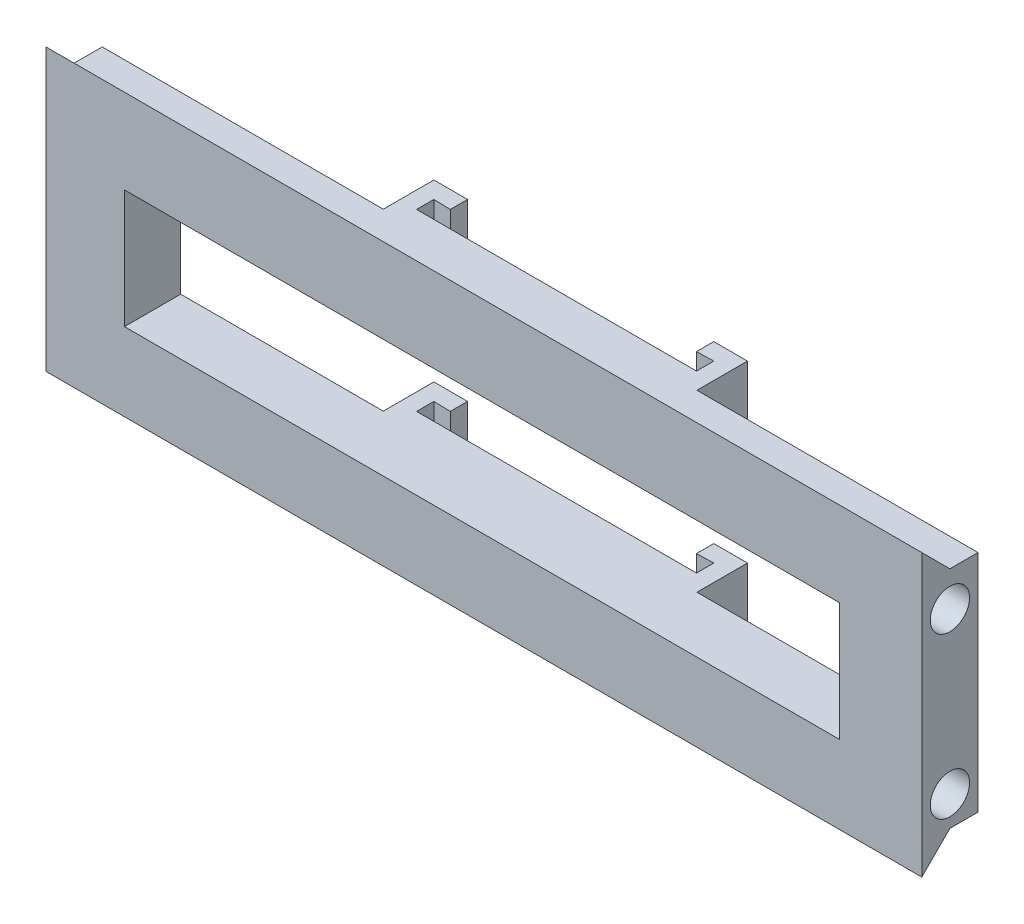
ISO-10303-21;
HEADER;
FILE_DESCRIPTION(('STEP AP214'),'2;1');
FILE_NAME('part.step','',(''),(''),'','','');
FILE_SCHEMA(('AUTOMOTIVE_DESIGN { 1 0 10303 214 1 1 1 1 }'));
ENDSEC;
DATA;
#1=APPLICATION_CONTEXT('core data for automotive mechanical design processes');
#2=APPLICATION_PROTOCOL_DEFINITION('international standard','automotive_design',2000,#1);
#3=PRODUCT_CONTEXT('',#1,'mechanical');
#4=PRODUCT('Part','Part','',(#3));
#5=PRODUCT_RELATED_PRODUCT_CATEGORY('part','',(#4));
#6=PRODUCT_DEFINITION_FORMATION('','',#4);
#7=PRODUCT_DEFINITION_CONTEXT('part definition',#1,'design');
#8=PRODUCT_DEFINITION('design','',#6,#7);
#9=PRODUCT_DEFINITION_SHAPE('','',#8);
#10=(LENGTH_UNIT() NAMED_UNIT(*) SI_UNIT(.MILLI.,.METRE.));
#11=(NAMED_UNIT(*) PLANE_ANGLE_UNIT() SI_UNIT($,.RADIAN.));
#12=(NAMED_UNIT(*) SI_UNIT($,.STERADIAN.) SOLID_ANGLE_UNIT());
#13=UNCERTAINTY_MEASURE_WITH_UNIT(LENGTH_MEASURE(1.E-05),#10,'distance_accuracy_value','');
#14=(GEOMETRIC_REPRESENTATION_CONTEXT(3) GLOBAL_UNCERTAINTY_ASSIGNED_CONTEXT((#13)) GLOBAL_UNIT_ASSIGNED_CONTEXT((#10,
#11,#12)) REPRESENTATION_CONTEXT('',''));
#15=CARTESIAN_POINT('',(0.,0.,0.));
#16=DIRECTION('',(0.,0.,1.));
#17=DIRECTION('',(1.,0.,0.));
#18=AXIS2_PLACEMENT_3D('',#15,#16,#17);
#19=CARTESIAN_POINT('',(0.,0.,0.));
#20=DIRECTION('',(0.,1.,0.));
#21=DIRECTION('',(0.,0.,1.));
#22=AXIS2_PLACEMENT_3D('',#19,#20,#21);
#23=PLANE('',#22);
#24=DIRECTION('',(1.,0.,0.));
#25=VECTOR('',#24,1.);
#26=CARTESIAN_POINT('',(-120.839198305537,0.,24.6440244675633));
#27=LINE('',#26,#25);
#28=CARTESIAN_POINT('',(-113.768130493671,0.,24.6440244675633));
#29=VERTEX_POINT('',#28);
#30=CARTESIAN_POINT('',(42.0318695063289,0.,24.6440244675633));
#31=VERTEX_POINT('',#30);
#32=EDGE_CURVE('E55',#29,#31,#27,.T.);
#33=ORIENTED_EDGE('',*,*,#32,.F.);
#34=DIRECTION('',(0.,0.,1.));
#35=VECTOR('',#34,1.);
#36=CARTESIAN_POINT('',(-113.768130493671,0.,0.));
#37=LINE('',#36,#35);
#38=CARTESIAN_POINT('',(-113.768130493671,0.,19.6440244675633));
#39=VERTEX_POINT('',#38);
#40=EDGE_CURVE('E268',#39,#29,#37,.T.);
#41=ORIENTED_EDGE('',*,*,#40,.F.);
#42=DIRECTION('',(-1.,0.,0.));
#43=VECTOR('',#42,1.);
#44=CARTESIAN_POINT('',(0.,0.,19.6440244675633));
#45=LINE('',#44,#43);
#46=CARTESIAN_POINT('',(-63.7681304936711,0.,19.6440244675633));
#47=VERTEX_POINT('',#46);
#48=EDGE_CURVE('E430',#47,#39,#45,.T.);
#49=ORIENTED_EDGE('',*,*,#48,.F.);
#50=DIRECTION('',(0.,0.,1.));
#51=VECTOR('',#50,1.);
#52=CARTESIAN_POINT('',(-63.7681304936711,0.,0.));
#53=LINE('',#52,#51);
#54=CARTESIAN_POINT('',(-63.7681304936711,0.,10.6440244675633));
#55=VERTEX_POINT('',#54);
#56=EDGE_CURVE('E428',#55,#47,#53,.T.);
#57=ORIENTED_EDGE('',*,*,#56,.F.);
#58=DIRECTION('',(1.,0.,0.));
#59=VECTOR('',#58,1.);
#60=CARTESIAN_POINT('',(0.,0.,10.6440244675633));
#61=LINE('',#60,#59);
#62=CARTESIAN_POINT('',(-57.7681304936711,0.,10.6440244675633));
#63=VERTEX_POINT('',#62);
#64=EDGE_CURVE('E425',#55,#63,#61,.T.);
#65=ORIENTED_EDGE('',*,*,#64,.T.);
#66=DIRECTION('',(0.,0.,1.));
#67=VECTOR('',#66,1.);
#68=CARTESIAN_POINT('',(-57.7681304936711,0.,0.));
#69=LINE('',#68,#67);
#70=CARTESIAN_POINT('',(-57.7681304936711,0.,13.7266501884196));
#71=VERTEX_POINT('',#70);
#72=EDGE_CURVE('E422',#63,#71,#69,.T.);
#73=ORIENTED_EDGE('',*,*,#72,.T.);
#74=DIRECTION('',(-0.999620937322477,0.,-0.0275314668430937));
#75=VECTOR('',#74,1.);
#76=CARTESIAN_POINT('',(-0.421558744951801,0.,15.306084131544));
#77=LINE('',#76,#75);
#78=CARTESIAN_POINT('',(-60.7681304936711,0.,13.6440244675633));
#79=VERTEX_POINT('',#78);
#80=EDGE_CURVE('E419',#71,#79,#77,.T.);
#81=ORIENTED_EDGE('',*,*,#80,.T.);
#82=DIRECTION('',(0.,0.,1.));
#83=VECTOR('',#82,1.);
#84=CARTESIAN_POINT('',(-60.7681304936711,0.,0.));
#85=LINE('',#84,#83);
#86=CARTESIAN_POINT('',(-60.7681304936711,0.,16.7266501884196));
#87=VERTEX_POINT('',#86);
#88=EDGE_CURVE('E416',#79,#87,#85,.T.);
#89=ORIENTED_EDGE('',*,*,#88,.T.);
#90=DIRECTION('',(1.,0.,0.));
#91=VECTOR('',#90,1.);
#92=CARTESIAN_POINT('',(0.,0.,16.7266501884196));
#93=LINE('',#92,#91);
#94=CARTESIAN_POINT('',(-10.9681304936711,0.,16.7266501884196));
#95=VERTEX_POINT('',#94);
#96=EDGE_CURVE('E413',#87,#95,#93,.T.);
#97=ORIENTED_EDGE('',*,*,#96,.T.);
#98=DIRECTION('',(0.,0.,-1.));
#99=VECTOR('',#98,1.);
#100=CARTESIAN_POINT('',(-10.9681304936711,0.,0.));
#101=LINE('',#100,#99);
#102=CARTESIAN_POINT('',(-10.9681304936711,0.,13.6440244675633));
#103=VERTEX_POINT('',#102);
#104=EDGE_CURVE('E410',#95,#103,#101,.T.);
#105=ORIENTED_EDGE('',*,*,#104,.T.);
#106=DIRECTION('',(0.999620937322477,0.,-0.0275314668430943));
#107=VECTOR('',#106,1.);
#108=CARTESIAN_POINT('',(0.367183974297822,0.,13.3318282912139));
#109=LINE('',#108,#107);
#110=CARTESIAN_POINT('',(-13.9681304936711,0.,13.7266501884196));
#111=VERTEX_POINT('',#110);
#112=EDGE_CURVE('E407',#111,#103,#109,.T.);
#113=ORIENTED_EDGE('',*,*,#112,.F.);
#114=DIRECTION('',(0.,0.,1.));
#115=VECTOR('',#114,1.);
#116=CARTESIAN_POINT('',(-13.9681304936711,0.,0.));
#117=LINE('',#116,#115);
#118=CARTESIAN_POINT('',(-13.9681304936711,0.,10.6440244675633));
#119=VERTEX_POINT('',#118);
#120=EDGE_CURVE('E403',#119,#111,#117,.T.);
#121=ORIENTED_EDGE('',*,*,#120,.F.);
#122=DIRECTION('',(1.,0.,0.));
#123=VECTOR('',#122,1.);
#124=CARTESIAN_POINT('',(0.,0.,10.6440244675633));
#125=LINE('',#124,#123);
#126=CARTESIAN_POINT('',(-7.96813049367114,0.,10.6440244675633));
#127=VERTEX_POINT('',#126);
#128=EDGE_CURVE('E400',#119,#127,#125,.T.);
#129=ORIENTED_EDGE('',*,*,#128,.T.);
#130=DIRECTION('',(0.,0.,1.));
#131=VECTOR('',#130,1.);
#132=CARTESIAN_POINT('',(-7.96813049367113,0.,0.));
#133=LINE('',#132,#131);
#134=CARTESIAN_POINT('',(-7.96813049367114,0.,19.6440244675633));
#135=VERTEX_POINT('',#134);
#136=EDGE_CURVE('E320',#127,#135,#133,.T.);
#137=ORIENTED_EDGE('',*,*,#136,.T.);
#138=DIRECTION('',(1.,0.,0.));
#139=VECTOR('',#138,1.);
#140=CARTESIAN_POINT('',(0.,0.,19.6440244675633));
#141=LINE('',#140,#139);
#142=CARTESIAN_POINT('',(42.0318695063289,0.,19.6440244675633));
#143=VERTEX_POINT('',#142);
#144=EDGE_CURVE('E265',#135,#143,#141,.T.);
#145=ORIENTED_EDGE('',*,*,#144,.T.);
#146=DIRECTION('',(0.,0.,1.));
#147=VECTOR('',#146,1.);
#148=CARTESIAN_POINT('',(42.0318695063289,0.,0.));
#149=LINE('',#148,#147);
#150=EDGE_CURVE('E262',#143,#31,#149,.T.);
#151=ORIENTED_EDGE('',*,*,#150,.T.);
#152=EDGE_LOOP('',(#33,#41,#49,#57,#65,#73,#81,#89,#97,#105,#113,#121,#129,#137,#145,#151));
#153=FACE_BOUND('',#152,.T.);
#154=ADVANCED_FACE('F38',(#153),#23,.F.);
#155=CARTESIAN_POINT('',(0.,40.,0.));
#156=DIRECTION('',(0.,1.,0.));
#157=DIRECTION('',(0.,0.,1.));
#158=AXIS2_PLACEMENT_3D('',#155,#156,#157);
#159=PLANE('',#158);
#160=DIRECTION('',(0.,0.,1.));
#161=VECTOR('',#160,1.);
#162=CARTESIAN_POINT('',(-113.768130493671,40.,0.));
#163=LINE('',#162,#161);
#164=CARTESIAN_POINT('',(-113.768130493671,40.,19.6440244675633));
#165=VERTEX_POINT('',#164);
#166=CARTESIAN_POINT('',(-113.768130493671,40.,24.6440244675633));
#167=VERTEX_POINT('',#166);
#168=EDGE_CURVE('E382',#165,#167,#163,.T.);
#169=ORIENTED_EDGE('',*,*,#168,.T.);
#170=DIRECTION('',(1.,0.,0.));
#171=VECTOR('',#170,1.);
#172=CARTESIAN_POINT('',(-120.839198305537,40.,24.6440244675633));
#173=LINE('',#172,#171);
#174=CARTESIAN_POINT('',(42.0318695063289,40.,24.6440244675633));
#175=VERTEX_POINT('',#174);
#176=EDGE_CURVE('E293',#167,#175,#173,.T.);
#177=ORIENTED_EDGE('',*,*,#176,.T.);
#178=DIRECTION('',(0.,0.,1.));
#179=VECTOR('',#178,1.);
#180=CARTESIAN_POINT('',(42.0318695063289,40.,0.));
#181=LINE('',#180,#179);
#182=CARTESIAN_POINT('',(42.0318695063289,40.,19.6440244675633));
#183=VERTEX_POINT('',#182);
#184=EDGE_CURVE('E386',#183,#175,#181,.T.);
#185=ORIENTED_EDGE('',*,*,#184,.F.);
#186=DIRECTION('',(1.,0.,0.));
#187=VECTOR('',#186,1.);
#188=CARTESIAN_POINT('',(0.,40.,19.6440244675633));
#189=LINE('',#188,#187);
#190=CARTESIAN_POINT('',(-7.96813049367114,40.,19.6440244675633));
#191=VERTEX_POINT('',#190);
#192=EDGE_CURVE('E394',#191,#183,#189,.T.);
#193=ORIENTED_EDGE('',*,*,#192,.F.);
#194=DIRECTION('',(0.,0.,1.));
#195=VECTOR('',#194,1.);
#196=CARTESIAN_POINT('',(-7.96813049367113,40.,0.));
#197=LINE('',#196,#195);
#198=CARTESIAN_POINT('',(-7.96813049367114,40.,10.6440244675633));
#199=VERTEX_POINT('',#198);
#200=EDGE_CURVE('E397',#199,#191,#197,.T.);
#201=ORIENTED_EDGE('',*,*,#200,.F.);
#202=DIRECTION('',(1.,0.,0.));
#203=VECTOR('',#202,1.);
#204=CARTESIAN_POINT('',(0.,40.,10.6440244675633));
#205=LINE('',#204,#203);
#206=CARTESIAN_POINT('',(-13.9681304936711,40.,10.6440244675633));
#207=VERTEX_POINT('',#206);
#208=EDGE_CURVE('E322',#207,#199,#205,.T.);
#209=ORIENTED_EDGE('',*,*,#208,.F.);
#210=DIRECTION('',(0.,0.,1.));
#211=VECTOR('',#210,1.);
#212=CARTESIAN_POINT('',(-13.9681304936711,40.,0.));
#213=LINE('',#212,#211);
#214=CARTESIAN_POINT('',(-13.9681304936711,40.,13.7266501884196));
#215=VERTEX_POINT('',#214);
#216=EDGE_CURVE('E887',#207,#215,#213,.T.);
#217=ORIENTED_EDGE('',*,*,#216,.T.);
#218=DIRECTION('',(0.999620937322477,0.,-0.0275314668430943));
#219=VECTOR('',#218,1.);
#220=CARTESIAN_POINT('',(0.367183974297822,40.,13.3318282912139));
#221=LINE('',#220,#219);
#222=CARTESIAN_POINT('',(-10.9681304936711,40.,13.6440244675633));
#223=VERTEX_POINT('',#222);
#224=EDGE_CURVE('E890',#215,#223,#221,.T.);
#225=ORIENTED_EDGE('',*,*,#224,.T.);
#226=DIRECTION('',(0.,0.,-1.));
#227=VECTOR('',#226,1.);
#228=CARTESIAN_POINT('',(-10.9681304936711,40.,0.));
#229=LINE('',#228,#227);
#230=CARTESIAN_POINT('',(-10.9681304936711,40.,16.7266501884196));
#231=VERTEX_POINT('',#230);
#232=EDGE_CURVE('E897',#231,#223,#229,.T.);
#233=ORIENTED_EDGE('',*,*,#232,.F.);
#234=DIRECTION('',(1.,0.,0.));
#235=VECTOR('',#234,1.);
#236=CARTESIAN_POINT('',(0.,40.,16.7266501884196));
#237=LINE('',#236,#235);
#238=CARTESIAN_POINT('',(-60.7681304936711,40.,16.7266501884196));
#239=VERTEX_POINT('',#238);
#240=EDGE_CURVE('E900',#239,#231,#237,.T.);
#241=ORIENTED_EDGE('',*,*,#240,.F.);
#242=DIRECTION('',(0.,0.,1.));
#243=VECTOR('',#242,1.);
#244=CARTESIAN_POINT('',(-60.7681304936711,40.,0.));
#245=LINE('',#244,#243);
#246=CARTESIAN_POINT('',(-60.7681304936711,40.,13.6440244675633));
#247=VERTEX_POINT('',#246);
#248=EDGE_CURVE('E903',#247,#239,#245,.T.);
#249=ORIENTED_EDGE('',*,*,#248,.F.);
#250=DIRECTION('',(-0.999620937322477,0.,-0.0275314668430937));
#251=VECTOR('',#250,1.);
#252=CARTESIAN_POINT('',(-0.421558744951801,40.,15.306084131544));
#253=LINE('',#252,#251);
#254=CARTESIAN_POINT('',(-57.7681304936711,40.,13.7266501884196));
#255=VERTEX_POINT('',#254);
#256=EDGE_CURVE('E906',#255,#247,#253,.T.);
#257=ORIENTED_EDGE('',*,*,#256,.F.);
#258=DIRECTION('',(0.,0.,1.));
#259=VECTOR('',#258,1.);
#260=CARTESIAN_POINT('',(-57.7681304936711,40.,0.));
#261=LINE('',#260,#259);
#262=CARTESIAN_POINT('',(-57.7681304936711,40.,10.6440244675633));
#263=VERTEX_POINT('',#262);
#264=EDGE_CURVE('E909',#263,#255,#261,.T.);
#265=ORIENTED_EDGE('',*,*,#264,.F.);
#266=DIRECTION('',(1.,0.,0.));
#267=VECTOR('',#266,1.);
#268=CARTESIAN_POINT('',(0.,40.,10.6440244675633));
#269=LINE('',#268,#267);
#270=CARTESIAN_POINT('',(-63.7681304936711,40.,10.6440244675633));
#271=VERTEX_POINT('',#270);
#272=EDGE_CURVE('E912',#271,#263,#269,.T.);
#273=ORIENTED_EDGE('',*,*,#272,.F.);
#274=DIRECTION('',(0.,0.,1.));
#275=VECTOR('',#274,1.);
#276=CARTESIAN_POINT('',(-63.7681304936711,40.,0.));
#277=LINE('',#276,#275);
#278=CARTESIAN_POINT('',(-63.7681304936711,40.,19.6440244675633));
#279=VERTEX_POINT('',#278);
#280=EDGE_CURVE('E914',#271,#279,#277,.T.);
#281=ORIENTED_EDGE('',*,*,#280,.T.);
#282=DIRECTION('',(-1.,0.,0.));
#283=VECTOR('',#282,1.);
#284=CARTESIAN_POINT('',(0.,40.,19.6440244675633));
#285=LINE('',#284,#283);
#286=EDGE_CURVE('E387',#279,#165,#285,.T.);
#287=ORIENTED_EDGE('',*,*,#286,.T.);
#288=EDGE_LOOP('',(#169,#177,#185,#193,#201,#209,#217,#225,#233,#241,#249,#257,#265,#273,#281,#287));
#289=FACE_BOUND('',#288,.T.);
#290=ADVANCED_FACE('F503',(#289),#159,.T.);
#291=CARTESIAN_POINT('',(0.,40.,10.6440244675633));
#292=DIRECTION('',(0.,0.,-1.));
#293=DIRECTION('',(-1.,0.,0.));
#294=AXIS2_PLACEMENT_3D('',#291,#292,#293);
#295=PLANE('',#294);
#296=DIRECTION('',(1.,0.,0.));
#297=VECTOR('',#296,1.);
#298=CARTESIAN_POINT('',(0.,29.9507303208034,10.6440244675633));
#299=LINE('',#298,#297);
#300=CARTESIAN_POINT('',(-13.9681304936711,29.9507303208034,10.6440244675633));
#301=VERTEX_POINT('',#300);
#302=CARTESIAN_POINT('',(-7.96813049367114,29.9507303208034,10.6440244675633));
#303=VERTEX_POINT('',#302);
#304=EDGE_CURVE('E878',#301,#303,#299,.T.);
#305=ORIENTED_EDGE('',*,*,#304,.F.);
#306=DIRECTION('',(0.,-1.,0.));
#307=VECTOR('',#306,1.);
#308=CARTESIAN_POINT('',(-13.9681304936711,40.,10.6440244675633));
#309=LINE('',#308,#307);
#310=EDGE_CURVE('E376',#207,#301,#309,.T.);
#311=ORIENTED_EDGE('',*,*,#310,.F.);
#312=ORIENTED_EDGE('',*,*,#208,.T.);
#313=DIRECTION('',(0.,-1.,0.));
#314=VECTOR('',#313,1.);
#315=CARTESIAN_POINT('',(-7.96813049367114,40.,10.6440244675633));
#316=LINE('',#315,#314);
#317=EDGE_CURVE('E323',#199,#303,#316,.T.);
#318=ORIENTED_EDGE('',*,*,#317,.T.);
#319=EDGE_LOOP('',(#305,#311,#312,#318));
#320=FACE_BOUND('',#319,.T.);
#321=ADVANCED_FACE('F526',(#320),#295,.T.);
#322=CARTESIAN_POINT('',(-13.9681304936711,40.,0.));
#323=DIRECTION('',(1.,0.,0.));
#324=DIRECTION('',(0.,0.,-1.));
#325=AXIS2_PLACEMENT_3D('',#322,#323,#324);
#326=PLANE('',#325);
#327=ORIENTED_EDGE('',*,*,#310,.T.);
#328=DIRECTION('',(0.,0.,1.));
#329=VECTOR('',#328,1.);
#330=CARTESIAN_POINT('',(-13.9681304936711,29.9507303208034,0.));
#331=LINE('',#330,#329);
#332=CARTESIAN_POINT('',(-13.9681304936711,29.9507303208034,13.7266501884196));
#333=VERTEX_POINT('',#332);
#334=EDGE_CURVE('E882',#301,#333,#331,.T.);
#335=ORIENTED_EDGE('',*,*,#334,.T.);
#336=DIRECTION('',(0.,-1.,0.));
#337=VECTOR('',#336,1.);
#338=CARTESIAN_POINT('',(-13.9681304936711,40.,13.7266501884196));
#339=LINE('',#338,#337);
#340=EDGE_CURVE('E372',#215,#333,#339,.T.);
#341=ORIENTED_EDGE('',*,*,#340,.F.);
#342=ORIENTED_EDGE('',*,*,#216,.F.);
#343=EDGE_LOOP('',(#327,#335,#341,#342));
#344=FACE_BOUND('',#343,.T.);
#345=ADVANCED_FACE('F764',(#344),#326,.F.);
#346=CARTESIAN_POINT('',(0.367183974297822,40.,13.3318282912139));
#347=DIRECTION('',(-0.0275314668430943,0.,-0.999620937322477));
#348=DIRECTION('',(-0.999620937322477,0.,0.0275314668430943));
#349=AXIS2_PLACEMENT_3D('',#346,#347,#348);
#350=PLANE('',#349);
#351=ORIENTED_EDGE('',*,*,#340,.T.);
#352=DIRECTION('',(0.999620937322477,0.,-0.0275314668430943));
#353=VECTOR('',#352,1.);
#354=CARTESIAN_POINT('',(0.367183974297822,29.9507303208034,13.3318282912139));
#355=LINE('',#354,#353);
#356=CARTESIAN_POINT('',(-10.9681304936711,29.9507303208034,13.6440244675633));
#357=VERTEX_POINT('',#356);
#358=EDGE_CURVE('E939',#333,#357,#355,.T.);
#359=ORIENTED_EDGE('',*,*,#358,.T.);
#360=DIRECTION('',(0.,-1.,0.));
#361=VECTOR('',#360,1.);
#362=CARTESIAN_POINT('',(-10.9681304936711,40.,13.6440244675633));
#363=LINE('',#362,#361);
#364=EDGE_CURVE('E368',#223,#357,#363,.T.);
#365=ORIENTED_EDGE('',*,*,#364,.F.);
#366=ORIENTED_EDGE('',*,*,#224,.F.);
#367=EDGE_LOOP('',(#351,#359,#365,#366));
#368=FACE_BOUND('',#367,.T.);
#369=ADVANCED_FACE('F756',(#368),#350,.F.);
#370=CARTESIAN_POINT('',(-10.9681304936711,40.,0.));
#371=DIRECTION('',(-1.,0.,0.));
#372=DIRECTION('',(0.,0.,1.));
#373=AXIS2_PLACEMENT_3D('',#370,#371,#372);
#374=PLANE('',#373);
#375=DIRECTION('',(0.,0.,-1.));
#376=VECTOR('',#375,1.);
#377=CARTESIAN_POINT('',(-10.9681304936711,29.9507303208034,0.));
#378=LINE('',#377,#376);
#379=CARTESIAN_POINT('',(-10.9681304936711,29.9507303208034,16.7266501884196));
#380=VERTEX_POINT('',#379);
#381=EDGE_CURVE('E937',#380,#357,#378,.T.);
#382=ORIENTED_EDGE('',*,*,#381,.F.);
#383=DIRECTION('',(0.,-1.,0.));
#384=VECTOR('',#383,1.);
#385=CARTESIAN_POINT('',(-10.9681304936711,40.,16.7266501884196));
#386=LINE('',#385,#384);
#387=EDGE_CURVE('E364',#231,#380,#386,.T.);
#388=ORIENTED_EDGE('',*,*,#387,.F.);
#389=ORIENTED_EDGE('',*,*,#232,.T.);
#390=ORIENTED_EDGE('',*,*,#364,.T.);
#391=EDGE_LOOP('',(#382,#388,#389,#390));
#392=FACE_BOUND('',#391,.T.);
#393=ADVANCED_FACE('F746',(#392),#374,.T.);
#394=CARTESIAN_POINT('',(0.,40.,16.7266501884196));
#395=DIRECTION('',(0.,0.,-1.));
#396=DIRECTION('',(-1.,0.,0.));
#397=AXIS2_PLACEMENT_3D('',#394,#395,#396);
#398=PLANE('',#397);
#399=DIRECTION('',(1.,0.,0.));
#400=VECTOR('',#399,1.);
#401=CARTESIAN_POINT('',(0.,29.9507303208034,16.7266501884196));
#402=LINE('',#401,#400);
#403=CARTESIAN_POINT('',(-60.7681304936711,29.9507303208034,16.7266501884196));
#404=VERTEX_POINT('',#403);
#405=EDGE_CURVE('E935',#404,#380,#402,.T.);
#406=ORIENTED_EDGE('',*,*,#405,.F.);
#407=DIRECTION('',(0.,-1.,0.));
#408=VECTOR('',#407,1.);
#409=CARTESIAN_POINT('',(-60.7681304936711,40.,16.7266501884196));
#410=LINE('',#409,#408);
#411=EDGE_CURVE('E360',#239,#404,#410,.T.);
#412=ORIENTED_EDGE('',*,*,#411,.F.);
#413=ORIENTED_EDGE('',*,*,#240,.T.);
#414=ORIENTED_EDGE('',*,*,#387,.T.);
#415=EDGE_LOOP('',(#406,#412,#413,#414));
#416=FACE_BOUND('',#415,.T.);
#417=ADVANCED_FACE('F736',(#416),#398,.T.);
#418=CARTESIAN_POINT('',(-60.7681304936711,40.,0.));
#419=DIRECTION('',(1.,0.,0.));
#420=DIRECTION('',(0.,0.,-1.));
#421=AXIS2_PLACEMENT_3D('',#418,#419,#420);
#422=PLANE('',#421);
#423=DIRECTION('',(0.,0.,1.));
#424=VECTOR('',#423,1.);
#425=CARTESIAN_POINT('',(-60.7681304936711,29.9507303208034,0.));
#426=LINE('',#425,#424);
#427=CARTESIAN_POINT('',(-60.7681304936711,29.9507303208034,13.6440244675633));
#428=VERTEX_POINT('',#427);
#429=EDGE_CURVE('E933',#428,#404,#426,.T.);
#430=ORIENTED_EDGE('',*,*,#429,.F.);
#431=DIRECTION('',(0.,-1.,0.));
#432=VECTOR('',#431,1.);
#433=CARTESIAN_POINT('',(-60.7681304936711,40.,13.6440244675633));
#434=LINE('',#433,#432);
#435=EDGE_CURVE('E356',#247,#428,#434,.T.);
#436=ORIENTED_EDGE('',*,*,#435,.F.);
#437=ORIENTED_EDGE('',*,*,#248,.T.);
#438=ORIENTED_EDGE('',*,*,#411,.T.);
#439=EDGE_LOOP('',(#430,#436,#437,#438));
#440=FACE_BOUND('',#439,.T.);
#441=ADVANCED_FACE('F727',(#440),#422,.T.);
#442=CARTESIAN_POINT('',(-0.421558744951801,40.,15.306084131544));
#443=DIRECTION('',(-0.0275314668430937,0.,0.999620937322477));
#444=DIRECTION('',(0.999620937322477,0.,0.0275314668430937));
#445=AXIS2_PLACEMENT_3D('',#442,#443,#444);
#446=PLANE('',#445);
#447=DIRECTION('',(-0.999620937322477,0.,-0.0275314668430937));
#448=VECTOR('',#447,1.);
#449=CARTESIAN_POINT('',(-0.421558744951801,29.9507303208034,15.306084131544));
#450=LINE('',#449,#448);
#451=CARTESIAN_POINT('',(-57.7681304936711,29.9507303208034,13.7266501884196));
#452=VERTEX_POINT('',#451);
#453=EDGE_CURVE('E931',#452,#428,#450,.T.);
#454=ORIENTED_EDGE('',*,*,#453,.F.);
#455=DIRECTION('',(0.,-1.,0.));
#456=VECTOR('',#455,1.);
#457=CARTESIAN_POINT('',(-57.7681304936711,40.,13.7266501884196));
#458=LINE('',#457,#456);
#459=EDGE_CURVE('E352',#255,#452,#458,.T.);
#460=ORIENTED_EDGE('',*,*,#459,.F.);
#461=ORIENTED_EDGE('',*,*,#256,.T.);
#462=ORIENTED_EDGE('',*,*,#435,.T.);
#463=EDGE_LOOP('',(#454,#460,#461,#462));
#464=FACE_BOUND('',#463,.T.);
#465=ADVANCED_FACE('F718',(#464),#446,.T.);
#466=CARTESIAN_POINT('',(-57.7681304936711,40.,0.));
#467=DIRECTION('',(1.,0.,0.));
#468=DIRECTION('',(0.,0.,-1.));
#469=AXIS2_PLACEMENT_3D('',#466,#467,#468);
#470=PLANE('',#469);
#471=DIRECTION('',(0.,0.,1.));
#472=VECTOR('',#471,1.);
#473=CARTESIAN_POINT('',(-57.7681304936711,29.9507303208034,0.));
#474=LINE('',#473,#472);
#475=CARTESIAN_POINT('',(-57.7681304936711,29.9507303208034,10.6440244675633));
#476=VERTEX_POINT('',#475);
#477=EDGE_CURVE('E927',#476,#452,#474,.T.);
#478=ORIENTED_EDGE('',*,*,#477,.F.);
#479=DIRECTION('',(0.,-1.,0.));
#480=VECTOR('',#479,1.);
#481=CARTESIAN_POINT('',(-57.7681304936711,40.,10.6440244675633));
#482=LINE('',#481,#480);
#483=EDGE_CURVE('E348',#263,#476,#482,.T.);
#484=ORIENTED_EDGE('',*,*,#483,.F.);
#485=ORIENTED_EDGE('',*,*,#264,.T.);
#486=ORIENTED_EDGE('',*,*,#459,.T.);
#487=EDGE_LOOP('',(#478,#484,#485,#486));
#488=FACE_BOUND('',#487,.T.);
#489=ADVANCED_FACE('F709',(#488),#470,.T.);
#490=CARTESIAN_POINT('',(0.,40.,10.6440244675633));
#491=DIRECTION('',(0.,0.,-1.));
#492=DIRECTION('',(-1.,0.,0.));
#493=AXIS2_PLACEMENT_3D('',#490,#491,#492);
#494=PLANE('',#493);
#495=DIRECTION('',(1.,0.,0.));
#496=VECTOR('',#495,1.);
#497=CARTESIAN_POINT('',(0.,29.9507303208034,10.6440244675633));
#498=LINE('',#497,#496);
#499=CARTESIAN_POINT('',(-63.7681304936711,29.9507303208034,10.6440244675633));
#500=VERTEX_POINT('',#499);
#501=EDGE_CURVE('E925',#500,#476,#498,.T.);
#502=ORIENTED_EDGE('',*,*,#501,.F.);
#503=DIRECTION('',(0.,-1.,0.));
#504=VECTOR('',#503,1.);
#505=CARTESIAN_POINT('',(-63.7681304936711,40.,10.6440244675633));
#506=LINE('',#505,#504);
#507=EDGE_CURVE('E344',#271,#500,#506,.T.);
#508=ORIENTED_EDGE('',*,*,#507,.F.);
#509=ORIENTED_EDGE('',*,*,#272,.T.);
#510=ORIENTED_EDGE('',*,*,#483,.T.);
#511=EDGE_LOOP('',(#502,#508,#509,#510));
#512=FACE_BOUND('',#511,.T.);
#513=ADVANCED_FACE('F697',(#512),#494,.T.);
#514=CARTESIAN_POINT('',(-63.7681304936711,40.,0.));
#515=DIRECTION('',(1.,0.,0.));
#516=DIRECTION('',(0.,0.,-1.));
#517=AXIS2_PLACEMENT_3D('',#514,#515,#516);
#518=PLANE('',#517);
#519=ORIENTED_EDGE('',*,*,#507,.T.);
#520=DIRECTION('',(0.,0.,1.));
#521=VECTOR('',#520,1.);
#522=CARTESIAN_POINT('',(-63.7681304936711,29.9507303208034,0.));
#523=LINE('',#522,#521);
#524=CARTESIAN_POINT('',(-63.7681304936711,29.9507303208034,19.6440244675633));
#525=VERTEX_POINT('',#524);
#526=EDGE_CURVE('E923',#500,#525,#523,.T.);
#527=ORIENTED_EDGE('',*,*,#526,.T.);
#528=DIRECTION('',(0.,-1.,0.));
#529=VECTOR('',#528,1.);
#530=CARTESIAN_POINT('',(-63.7681304936711,40.,19.6440244675633));
#531=LINE('',#530,#529);
#532=EDGE_CURVE('E340',#279,#525,#531,.T.);
#533=ORIENTED_EDGE('',*,*,#532,.F.);
#534=ORIENTED_EDGE('',*,*,#280,.F.);
#535=EDGE_LOOP('',(#519,#527,#533,#534));
#536=FACE_BOUND('',#535,.T.);
#537=ADVANCED_FACE('F689',(#536),#518,.F.);
#538=CARTESIAN_POINT('',(-7.96813049367113,40.,0.));
#539=DIRECTION('',(1.,0.,0.));
#540=DIRECTION('',(0.,0.,-1.));
#541=AXIS2_PLACEMENT_3D('',#538,#539,#540);
#542=PLANE('',#541);
#543=DIRECTION('',(0.,0.,1.));
#544=VECTOR('',#543,1.);
#545=CARTESIAN_POINT('',(-7.96813049367113,29.9507303208034,0.));
#546=LINE('',#545,#544);
#547=CARTESIAN_POINT('',(-7.96813049367114,29.9507303208034,19.6440244675633));
#548=VERTEX_POINT('',#547);
#549=EDGE_CURVE('E47',#303,#548,#546,.T.);
#550=ORIENTED_EDGE('',*,*,#549,.F.);
#551=ORIENTED_EDGE('',*,*,#317,.F.);
#552=ORIENTED_EDGE('',*,*,#200,.T.);
#553=DIRECTION('',(0.,-1.,0.));
#554=VECTOR('',#553,1.);
#555=CARTESIAN_POINT('',(-7.96813049367114,40.,19.6440244675633));
#556=LINE('',#555,#554);
#557=EDGE_CURVE('E328',#191,#548,#556,.T.);
#558=ORIENTED_EDGE('',*,*,#557,.T.);
#559=EDGE_LOOP('',(#550,#551,#552,#558));
#560=FACE_BOUND('',#559,.T.);
#561=ADVANCED_FACE('F533',(#560),#542,.T.);
#562=DIRECTION('',(-1.,0.,0.));
#563=VECTOR('',#562,1.);
#564=CARTESIAN_POINT('',(0.,8.88626127996961,10.6440244675633));
#565=LINE('',#564,#563);
#566=CARTESIAN_POINT('',(-7.96813049367114,8.88626127996961,10.6440244675633));
#567=VERTEX_POINT('',#566);
#568=CARTESIAN_POINT('',(-13.9681304936711,8.88626127996961,10.6440244675633));
#569=VERTEX_POINT('',#568);
#570=EDGE_CURVE('E490',#567,#569,#565,.T.);
#571=ORIENTED_EDGE('',*,*,#570,.F.);
#572=EDGE_CURVE('E327',#567,#127,#316,.T.);
#573=ORIENTED_EDGE('',*,*,#572,.T.);
#574=ORIENTED_EDGE('',*,*,#128,.F.);
#575=EDGE_CURVE('E375',#569,#119,#309,.T.);
#576=ORIENTED_EDGE('',*,*,#575,.F.);
#577=EDGE_LOOP('',(#571,#573,#574,#576));
#578=FACE_BOUND('',#577,.T.);
#579=ADVANCED_FACE('F40',(#578),#295,.T.);
#580=CARTESIAN_POINT('',(-13.9681304936711,8.88626127996961,13.7266501884196));
#581=VERTEX_POINT('',#580);
#582=EDGE_CURVE('E371',#581,#111,#339,.T.);
#583=ORIENTED_EDGE('',*,*,#582,.F.);
#584=DIRECTION('',(0.,0.,-1.));
#585=VECTOR('',#584,1.);
#586=CARTESIAN_POINT('',(-13.9681304936711,8.88626127996961,0.));
#587=LINE('',#586,#585);
#588=EDGE_CURVE('E959',#581,#569,#587,.T.);
#589=ORIENTED_EDGE('',*,*,#588,.T.);
#590=ORIENTED_EDGE('',*,*,#575,.T.);
#591=ORIENTED_EDGE('',*,*,#120,.T.);
#592=EDGE_LOOP('',(#583,#589,#590,#591));
#593=FACE_BOUND('',#592,.T.);
#594=ADVANCED_FACE('F483',(#593),#326,.F.);
#595=CARTESIAN_POINT('',(-10.9681304936711,8.88626127996961,13.6440244675633));
#596=VERTEX_POINT('',#595);
#597=EDGE_CURVE('E367',#596,#103,#363,.T.);
#598=ORIENTED_EDGE('',*,*,#597,.F.);
#599=DIRECTION('',(-0.999620937322477,0.,0.0275314668430943));
#600=VECTOR('',#599,1.);
#601=CARTESIAN_POINT('',(0.367183974297822,8.88626127996961,13.3318282912139));
#602=LINE('',#601,#600);
#603=EDGE_CURVE('E480',#596,#581,#602,.T.);
#604=ORIENTED_EDGE('',*,*,#603,.T.);
#605=ORIENTED_EDGE('',*,*,#582,.T.);
#606=ORIENTED_EDGE('',*,*,#112,.T.);
#607=EDGE_LOOP('',(#598,#604,#605,#606));
#608=FACE_BOUND('',#607,.T.);
#609=ADVANCED_FACE('F478',(#608),#350,.F.);
#610=DIRECTION('',(0.,0.,1.));
#611=VECTOR('',#610,1.);
#612=CARTESIAN_POINT('',(-10.9681304936711,8.88626127996961,0.));
#613=LINE('',#612,#611);
#614=CARTESIAN_POINT('',(-10.9681304936711,8.88626127996961,16.7266501884196));
#615=VERTEX_POINT('',#614);
#616=EDGE_CURVE('E475',#596,#615,#613,.T.);
#617=ORIENTED_EDGE('',*,*,#616,.F.);
#618=ORIENTED_EDGE('',*,*,#597,.T.);
#619=ORIENTED_EDGE('',*,*,#104,.F.);
#620=EDGE_CURVE('E363',#615,#95,#386,.T.);
#621=ORIENTED_EDGE('',*,*,#620,.F.);
#622=EDGE_LOOP('',(#617,#618,#619,#621));
#623=FACE_BOUND('',#622,.T.);
#624=ADVANCED_FACE('F473',(#623),#374,.T.);
#625=DIRECTION('',(-1.,0.,0.));
#626=VECTOR('',#625,1.);
#627=CARTESIAN_POINT('',(0.,8.88626127996961,16.7266501884196));
#628=LINE('',#627,#626);
#629=CARTESIAN_POINT('',(-60.7681304936711,8.88626127996961,16.7266501884196));
#630=VERTEX_POINT('',#629);
#631=EDGE_CURVE('E955',#615,#630,#628,.T.);
#632=ORIENTED_EDGE('',*,*,#631,.F.);
#633=ORIENTED_EDGE('',*,*,#620,.T.);
#634=ORIENTED_EDGE('',*,*,#96,.F.);
#635=EDGE_CURVE('E359',#630,#87,#410,.T.);
#636=ORIENTED_EDGE('',*,*,#635,.F.);
#637=EDGE_LOOP('',(#632,#633,#634,#636));
#638=FACE_BOUND('',#637,.T.);
#639=ADVANCED_FACE('F466',(#638),#398,.T.);
#640=DIRECTION('',(0.,0.,-1.));
#641=VECTOR('',#640,1.);
#642=CARTESIAN_POINT('',(-60.7681304936711,8.88626127996961,0.));
#643=LINE('',#642,#641);
#644=CARTESIAN_POINT('',(-60.7681304936711,8.88626127996961,13.6440244675633));
#645=VERTEX_POINT('',#644);
#646=EDGE_CURVE('E463',#630,#645,#643,.T.);
#647=ORIENTED_EDGE('',*,*,#646,.F.);
#648=ORIENTED_EDGE('',*,*,#635,.T.);
#649=ORIENTED_EDGE('',*,*,#88,.F.);
#650=EDGE_CURVE('E355',#645,#79,#434,.T.);
#651=ORIENTED_EDGE('',*,*,#650,.F.);
#652=EDGE_LOOP('',(#647,#648,#649,#651));
#653=FACE_BOUND('',#652,.T.);
#654=ADVANCED_FACE('F460',(#653),#422,.T.);
#655=DIRECTION('',(0.999620937322477,0.,0.0275314668430937));
#656=VECTOR('',#655,1.);
#657=CARTESIAN_POINT('',(-0.421558744951801,8.88626127996961,15.306084131544));
#658=LINE('',#657,#656);
#659=CARTESIAN_POINT('',(-57.7681304936711,8.88626127996961,13.7266501884196));
#660=VERTEX_POINT('',#659);
#661=EDGE_CURVE('E457',#645,#660,#658,.T.);
#662=ORIENTED_EDGE('',*,*,#661,.F.);
#663=ORIENTED_EDGE('',*,*,#650,.T.);
#664=ORIENTED_EDGE('',*,*,#80,.F.);
#665=EDGE_CURVE('E351',#660,#71,#458,.T.);
#666=ORIENTED_EDGE('',*,*,#665,.F.);
#667=EDGE_LOOP('',(#662,#663,#664,#666));
#668=FACE_BOUND('',#667,.T.);
#669=ADVANCED_FACE('F455',(#668),#446,.T.);
#670=DIRECTION('',(0.,0.,-1.));
#671=VECTOR('',#670,1.);
#672=CARTESIAN_POINT('',(-57.7681304936711,8.88626127996961,0.));
#673=LINE('',#672,#671);
#674=CARTESIAN_POINT('',(-57.7681304936711,8.88626127996961,10.6440244675633));
#675=VERTEX_POINT('',#674);
#676=EDGE_CURVE('E951',#660,#675,#673,.T.);
#677=ORIENTED_EDGE('',*,*,#676,.F.);
#678=ORIENTED_EDGE('',*,*,#665,.T.);
#679=ORIENTED_EDGE('',*,*,#72,.F.);
#680=EDGE_CURVE('E347',#675,#63,#482,.T.);
#681=ORIENTED_EDGE('',*,*,#680,.F.);
#682=EDGE_LOOP('',(#677,#678,#679,#681));
#683=FACE_BOUND('',#682,.T.);
#684=ADVANCED_FACE('F449',(#683),#470,.T.);
#685=DIRECTION('',(-1.,0.,0.));
#686=VECTOR('',#685,1.);
#687=CARTESIAN_POINT('',(0.,8.88626127996961,10.6440244675633));
#688=LINE('',#687,#686);
#689=CARTESIAN_POINT('',(-63.7681304936711,8.88626127996961,10.6440244675633));
#690=VERTEX_POINT('',#689);
#691=EDGE_CURVE('E446',#675,#690,#688,.T.);
#692=ORIENTED_EDGE('',*,*,#691,.F.);
#693=ORIENTED_EDGE('',*,*,#680,.T.);
#694=ORIENTED_EDGE('',*,*,#64,.F.);
#695=EDGE_CURVE('E343',#690,#55,#506,.T.);
#696=ORIENTED_EDGE('',*,*,#695,.F.);
#697=EDGE_LOOP('',(#692,#693,#694,#696));
#698=FACE_BOUND('',#697,.T.);
#699=ADVANCED_FACE('F443',(#698),#494,.T.);
#700=CARTESIAN_POINT('',(-63.7681304936711,8.88626127996961,19.6440244675633));
#701=VERTEX_POINT('',#700);
#702=EDGE_CURVE('E339',#701,#47,#531,.T.);
#703=ORIENTED_EDGE('',*,*,#702,.F.);
#704=DIRECTION('',(0.,0.,-1.));
#705=VECTOR('',#704,1.);
#706=CARTESIAN_POINT('',(-63.7681304936711,8.88626127996961,0.));
#707=LINE('',#706,#705);
#708=EDGE_CURVE('E947',#701,#690,#707,.T.);
#709=ORIENTED_EDGE('',*,*,#708,.T.);
#710=ORIENTED_EDGE('',*,*,#695,.T.);
#711=ORIENTED_EDGE('',*,*,#56,.T.);
#712=EDGE_LOOP('',(#703,#709,#710,#711));
#713=FACE_BOUND('',#712,.T.);
#714=ADVANCED_FACE('F680',(#713),#518,.F.);
#715=CARTESIAN_POINT('',(0.,40.,19.6440244675633));
#716=DIRECTION('',(0.,0.,1.));
#717=DIRECTION('',(1.,0.,0.));
#718=AXIS2_PLACEMENT_3D('',#715,#716,#717);
#719=PLANE('',#718);
#720=ORIENTED_EDGE('',*,*,#532,.T.);
#721=DIRECTION('',(-1.,0.,0.));
#722=VECTOR('',#721,1.);
#723=CARTESIAN_POINT('',(0.,29.9507303208034,19.6440244675633));
#724=LINE('',#723,#722);
#725=CARTESIAN_POINT('',(-99.8071568272568,29.9507303208034,19.6440244675633));
#726=VERTEX_POINT('',#725);
#727=EDGE_CURVE('E921',#525,#726,#724,.T.);
#728=ORIENTED_EDGE('',*,*,#727,.T.);
#729=DIRECTION('',(0.,-1.,0.));
#730=VECTOR('',#729,1.);
#731=CARTESIAN_POINT('',(-99.8071568272568,40.,19.6440244675633));
#732=LINE('',#731,#730);
#733=CARTESIAN_POINT('',(-99.8071568272568,8.88626127996961,19.6440244675633));
#734=VERTEX_POINT('',#733);
#735=EDGE_CURVE('E404',#726,#734,#732,.T.);
#736=ORIENTED_EDGE('',*,*,#735,.T.);
#737=DIRECTION('',(1.,0.,0.));
#738=VECTOR('',#737,1.);
#739=CARTESIAN_POINT('',(0.,8.88626127996961,19.6440244675633));
#740=LINE('',#739,#738);
#741=EDGE_CURVE('E944',#734,#701,#740,.T.);
#742=ORIENTED_EDGE('',*,*,#741,.T.);
#743=ORIENTED_EDGE('',*,*,#702,.T.);
#744=ORIENTED_EDGE('',*,*,#48,.T.);
#745=DIRECTION('',(0.,-1.,0.));
#746=VECTOR('',#745,1.);
#747=CARTESIAN_POINT('',(-113.768130493671,40.,19.6440244675633));
#748=LINE('',#747,#746);
#749=EDGE_CURVE('E336',#165,#39,#748,.T.);
#750=ORIENTED_EDGE('',*,*,#749,.F.);
#751=ORIENTED_EDGE('',*,*,#286,.F.);
#752=EDGE_LOOP('',(#720,#728,#736,#742,#743,#744,#750,#751));
#753=FACE_BOUND('',#752,.T.);
#754=ADVANCED_FACE('F518',(#753),#719,.F.);
#755=CARTESIAN_POINT('',(-113.768130493671,40.,0.));
#756=DIRECTION('',(1.,0.,0.));
#757=DIRECTION('',(0.,0.,-1.));
#758=AXIS2_PLACEMENT_3D('',#755,#756,#757);
#759=PLANE('',#758);
#760=ORIENTED_EDGE('',*,*,#40,.T.);
#761=DIRECTION('',(0.,-0.707106781186548,0.707106781186547));
#762=VECTOR('',#761,1.);
#763=CARTESIAN_POINT('',(-113.768130493671,-5.,29.6440244675633));
#764=LINE('',#763,#762);
#765=CARTESIAN_POINT('',(-113.768130493671,-5.,29.6440244675633));
#766=VERTEX_POINT('',#765);
#767=EDGE_CURVE('E277',#29,#766,#764,.T.);
#768=ORIENTED_EDGE('',*,*,#767,.T.);
#769=DIRECTION('',(0.,-1.,0.));
#770=VECTOR('',#769,1.);
#771=CARTESIAN_POINT('',(-113.768130493671,40.,29.6440244675633));
#772=LINE('',#771,#770);
#773=CARTESIAN_POINT('',(-113.768130493671,45.,29.6440244675633));
#774=VERTEX_POINT('',#773);
#775=EDGE_CURVE('E334',#774,#766,#772,.T.);
#776=ORIENTED_EDGE('',*,*,#775,.F.);
#777=DIRECTION('',(0.,-0.707106781186548,-0.707106781186547));
#778=VECTOR('',#777,1.);
#779=CARTESIAN_POINT('',(-113.768130493671,40.,24.6440244675633));
#780=LINE('',#779,#778);
#781=EDGE_CURVE('E302',#774,#167,#780,.T.);
#782=ORIENTED_EDGE('',*,*,#781,.T.);
#783=ORIENTED_EDGE('',*,*,#168,.F.);
#784=ORIENTED_EDGE('',*,*,#749,.T.);
#785=EDGE_LOOP('',(#760,#768,#776,#782,#783,#784));
#786=FACE_BOUND('',#785,.T.);
#787=ADVANCED_FACE('F434',(#786),#759,.F.);
#788=CARTESIAN_POINT('',(0.,40.,29.6440244675633));
#789=DIRECTION('',(0.,0.,-1.));
#790=DIRECTION('',(-1.,0.,0.));
#791=AXIS2_PLACEMENT_3D('',#788,#789,#790);
#792=PLANE('',#791);
#793=DIRECTION('',(1.,0.,0.));
#794=VECTOR('',#793,1.);
#795=CARTESIAN_POINT('',(-99.8071568272568,8.88626127996961,29.6440244675633));
#796=LINE('',#795,#794);
#797=CARTESIAN_POINT('',(-99.8071568272568,8.88626127996961,29.6440244675633));
#798=VERTEX_POINT('',#797);
#799=CARTESIAN_POINT('',(27.404071231481,8.88626127996961,29.6440244675633));
#800=VERTEX_POINT('',#799);
#801=EDGE_CURVE('E978',#798,#800,#796,.T.);
#802=ORIENTED_EDGE('',*,*,#801,.F.);
#803=DIRECTION('',(0.,-1.,0.));
#804=VECTOR('',#803,1.);
#805=CARTESIAN_POINT('',(-99.8071568272568,29.9507303208034,29.6440244675633));
#806=LINE('',#805,#804);
#807=CARTESIAN_POINT('',(-99.8071568272568,29.9507303208034,29.6440244675633));
#808=VERTEX_POINT('',#807);
#809=EDGE_CURVE('E305',#808,#798,#806,.T.);
#810=ORIENTED_EDGE('',*,*,#809,.F.);
#811=DIRECTION('',(-1.,0.,0.));
#812=VECTOR('',#811,1.);
#813=CARTESIAN_POINT('',(-99.8071568272568,29.9507303208034,29.6440244675633));
#814=LINE('',#813,#812);
#815=CARTESIAN_POINT('',(27.404071231481,29.9507303208034,29.6440244675633));
#816=VERTEX_POINT('',#815);
#817=EDGE_CURVE('E969',#816,#808,#814,.T.);
#818=ORIENTED_EDGE('',*,*,#817,.F.);
#819=DIRECTION('',(0.,1.,0.));
#820=VECTOR('',#819,1.);
#821=CARTESIAN_POINT('',(27.404071231481,29.9507303208034,29.6440244675633));
#822=LINE('',#821,#820);
#823=EDGE_CURVE('E976',#800,#816,#822,.T.);
#824=ORIENTED_EDGE('',*,*,#823,.F.);
#825=EDGE_LOOP('',(#802,#810,#818,#824));
#826=FACE_BOUND('',#825,.T.);
#827=ORIENTED_EDGE('',*,*,#775,.T.);
#828=DIRECTION('',(1.,0.,0.));
#829=VECTOR('',#828,1.);
#830=CARTESIAN_POINT('',(-120.839198305537,-5.,29.6440244675633));
#831=LINE('',#830,#829);
#832=CARTESIAN_POINT('',(42.0318695063289,-5.,29.6440244675633));
#833=VERTEX_POINT('',#832);
#834=EDGE_CURVE('E278',#766,#833,#831,.T.);
#835=ORIENTED_EDGE('',*,*,#834,.T.);
#836=DIRECTION('',(0.,-1.,0.));
#837=VECTOR('',#836,1.);
#838=CARTESIAN_POINT('',(42.0318695063289,40.,29.6440244675633));
#839=LINE('',#838,#837);
#840=CARTESIAN_POINT('',(42.0318695063289,45.,29.6440244675633));
#841=VERTEX_POINT('',#840);
#842=EDGE_CURVE('E281',#841,#833,#839,.T.);
#843=ORIENTED_EDGE('',*,*,#842,.F.);
#844=DIRECTION('',(1.,0.,0.));
#845=VECTOR('',#844,1.);
#846=CARTESIAN_POINT('',(-120.839198305537,45.,29.6440244675633));
#847=LINE('',#846,#845);
#848=EDGE_CURVE('E300',#774,#841,#847,.T.);
#849=ORIENTED_EDGE('',*,*,#848,.F.);
#850=EDGE_LOOP('',(#827,#835,#843,#849));
#851=FACE_BOUND('',#850,.T.);
#852=ADVANCED_FACE('F508',(#826,#851),#792,.F.);
#853=CARTESIAN_POINT('',(42.0318695063289,40.,0.));
#854=DIRECTION('',(1.,0.,0.));
#855=DIRECTION('',(0.,0.,-1.));
#856=AXIS2_PLACEMENT_3D('',#853,#854,#855);
#857=PLANE('',#856);
#858=CARTESIAN_POINT('',(42.0318695063289,5.30357402131715,24.6440244675633));
#859=DIRECTION('',(1.,0.,0.));
#860=DIRECTION('',(0.,0.,-1.));
#861=AXIS2_PLACEMENT_3D('',#858,#859,#860);
#862=CIRCLE('',#861,3.5);
#863=CARTESIAN_POINT('',(42.0318695063289,5.30357402131715,21.1440244675633));
#864=VERTEX_POINT('',#863);
#865=EDGE_CURVE('E1024',#864,#864,#862,.T.);
#866=ORIENTED_EDGE('',*,*,#865,.F.);
#867=EDGE_LOOP('',(#866));
#868=FACE_BOUND('',#867,.T.);
#869=CARTESIAN_POINT('',(42.0318695063289,33.8062033988192,24.6440244675633));
#870=DIRECTION('',(1.,0.,0.));
#871=DIRECTION('',(0.,0.,-1.));
#872=AXIS2_PLACEMENT_3D('',#869,#870,#871);
#873=CIRCLE('',#872,3.5);
#874=CARTESIAN_POINT('',(42.0318695063289,33.8062033988192,21.1440244675633));
#875=VERTEX_POINT('',#874);
#876=EDGE_CURVE('E286',#875,#875,#873,.T.);
#877=ORIENTED_EDGE('',*,*,#876,.F.);
#878=EDGE_LOOP('',(#877));
#879=FACE_BOUND('',#878,.T.);
#880=ORIENTED_EDGE('',*,*,#150,.F.);
#881=DIRECTION('',(0.,-1.,0.));
#882=VECTOR('',#881,1.);
#883=CARTESIAN_POINT('',(42.0318695063289,40.,19.6440244675633));
#884=LINE('',#883,#882);
#885=EDGE_CURVE('E331',#183,#143,#884,.T.);
#886=ORIENTED_EDGE('',*,*,#885,.F.);
#887=ORIENTED_EDGE('',*,*,#184,.T.);
#888=DIRECTION('',(0.,0.707106781186548,0.707106781186547));
#889=VECTOR('',#888,1.);
#890=CARTESIAN_POINT('',(42.0318695063289,40.,24.6440244675633));
#891=LINE('',#890,#889);
#892=EDGE_CURVE('E63',#175,#841,#891,.T.);
#893=ORIENTED_EDGE('',*,*,#892,.T.);
#894=ORIENTED_EDGE('',*,*,#842,.T.);
#895=DIRECTION('',(0.,0.707106781186548,-0.707106781186547));
#896=VECTOR('',#895,1.);
#897=CARTESIAN_POINT('',(42.0318695063289,-5.,29.6440244675633));
#898=LINE('',#897,#896);
#899=EDGE_CURVE('E275',#833,#31,#898,.T.);
#900=ORIENTED_EDGE('',*,*,#899,.T.);
#901=EDGE_LOOP('',(#880,#886,#887,#893,#894,#900));
#902=FACE_BOUND('',#901,.T.);
#903=ADVANCED_FACE('F280',(#868,#879,#902),#857,.T.);
#904=CARTESIAN_POINT('',(0.,40.,19.6440244675633));
#905=DIRECTION('',(0.,0.,-1.));
#906=DIRECTION('',(-1.,0.,0.));
#907=AXIS2_PLACEMENT_3D('',#904,#905,#906);
#908=PLANE('',#907);
#909=DIRECTION('',(1.,0.,0.));
#910=VECTOR('',#909,1.);
#911=CARTESIAN_POINT('',(0.,29.9507303208034,19.6440244675633));
#912=LINE('',#911,#910);
#913=CARTESIAN_POINT('',(27.404071231481,29.9507303208034,19.6440244675633));
#914=VERTEX_POINT('',#913);
#915=EDGE_CURVE('E883',#548,#914,#912,.T.);
#916=ORIENTED_EDGE('',*,*,#915,.F.);
#917=ORIENTED_EDGE('',*,*,#557,.F.);
#918=ORIENTED_EDGE('',*,*,#192,.T.);
#919=ORIENTED_EDGE('',*,*,#885,.T.);
#920=ORIENTED_EDGE('',*,*,#144,.F.);
#921=CARTESIAN_POINT('',(-7.96813049367114,8.88626127996961,19.6440244675633));
#922=VERTEX_POINT('',#921);
#923=EDGE_CURVE('E326',#922,#135,#556,.T.);
#924=ORIENTED_EDGE('',*,*,#923,.F.);
#925=DIRECTION('',(-1.,0.,0.));
#926=VECTOR('',#925,1.);
#927=CARTESIAN_POINT('',(0.,8.88626127996961,19.6440244675633));
#928=LINE('',#927,#926);
#929=CARTESIAN_POINT('',(27.404071231481,8.88626127996961,19.6440244675633));
#930=VERTEX_POINT('',#929);
#931=EDGE_CURVE('E962',#930,#922,#928,.T.);
#932=ORIENTED_EDGE('',*,*,#931,.F.);
#933=DIRECTION('',(0.,-1.,0.));
#934=VECTOR('',#933,1.);
#935=CARTESIAN_POINT('',(27.404071231481,40.,19.6440244675633));
#936=LINE('',#935,#934);
#937=EDGE_CURVE('E11',#914,#930,#936,.T.);
#938=ORIENTED_EDGE('',*,*,#937,.F.);
#939=EDGE_LOOP('',(#916,#917,#918,#919,#920,#924,#932,#938));
#940=FACE_BOUND('',#939,.T.);
#941=ADVANCED_FACE('F498',(#940),#908,.T.);
#942=DIRECTION('',(0.,0.,-1.));
#943=VECTOR('',#942,1.);
#944=CARTESIAN_POINT('',(-7.96813049367113,8.88626127996961,0.));
#945=LINE('',#944,#943);
#946=EDGE_CURVE('E379',#922,#567,#945,.T.);
#947=ORIENTED_EDGE('',*,*,#946,.F.);
#948=ORIENTED_EDGE('',*,*,#923,.T.);
#949=ORIENTED_EDGE('',*,*,#136,.F.);
#950=ORIENTED_EDGE('',*,*,#572,.F.);
#951=EDGE_LOOP('',(#947,#948,#949,#950));
#952=FACE_BOUND('',#951,.T.);
#953=ADVANCED_FACE('F493',(#952),#542,.T.);
#954=CARTESIAN_POINT('',(-99.8071568272568,29.9507303208034,-30.3559755324367));
#955=DIRECTION('',(-1.,0.,0.));
#956=DIRECTION('',(0.,0.,1.));
#957=AXIS2_PLACEMENT_3D('',#954,#955,#956);
#958=PLANE('',#957);
#959=DIRECTION('',(0.,0.,1.));
#960=VECTOR('',#959,1.);
#961=CARTESIAN_POINT('',(-99.8071568272568,29.9507303208034,-30.3559755324367));
#962=LINE('',#961,#960);
#963=EDGE_CURVE('E964',#726,#808,#962,.T.);
#964=ORIENTED_EDGE('',*,*,#963,.T.);
#965=ORIENTED_EDGE('',*,*,#809,.T.);
#966=DIRECTION('',(0.,0.,1.));
#967=VECTOR('',#966,1.);
#968=CARTESIAN_POINT('',(-99.8071568272568,8.88626127996961,-30.3559755324367));
#969=LINE('',#968,#967);
#970=EDGE_CURVE('E965',#734,#798,#969,.T.);
#971=ORIENTED_EDGE('',*,*,#970,.F.);
#972=ORIENTED_EDGE('',*,*,#735,.F.);
#973=EDGE_LOOP('',(#964,#965,#971,#972));
#974=FACE_BOUND('',#973,.T.);
#975=ADVANCED_FACE('F532',(#974),#958,.F.);
#976=CARTESIAN_POINT('',(-99.8071568272568,29.9507303208034,-30.3559755324367));
#977=DIRECTION('',(0.,1.,0.));
#978=DIRECTION('',(0.,0.,1.));
#979=AXIS2_PLACEMENT_3D('',#976,#977,#978);
#980=PLANE('',#979);
#981=ORIENTED_EDGE('',*,*,#526,.F.);
#982=ORIENTED_EDGE('',*,*,#501,.T.);
#983=ORIENTED_EDGE('',*,*,#477,.T.);
#984=ORIENTED_EDGE('',*,*,#453,.T.);
#985=ORIENTED_EDGE('',*,*,#429,.T.);
#986=ORIENTED_EDGE('',*,*,#405,.T.);
#987=ORIENTED_EDGE('',*,*,#381,.T.);
#988=ORIENTED_EDGE('',*,*,#358,.F.);
#989=ORIENTED_EDGE('',*,*,#334,.F.);
#990=ORIENTED_EDGE('',*,*,#304,.T.);
#991=ORIENTED_EDGE('',*,*,#549,.T.);
#992=ORIENTED_EDGE('',*,*,#915,.T.);
#993=DIRECTION('',(0.,0.,1.));
#994=VECTOR('',#993,1.);
#995=CARTESIAN_POINT('',(27.404071231481,29.9507303208034,-30.3559755324367));
#996=LINE('',#995,#994);
#997=EDGE_CURVE('E971',#914,#816,#996,.T.);
#998=ORIENTED_EDGE('',*,*,#997,.T.);
#999=ORIENTED_EDGE('',*,*,#817,.T.);
#1000=ORIENTED_EDGE('',*,*,#963,.F.);
#1001=ORIENTED_EDGE('',*,*,#727,.F.);
#1002=EDGE_LOOP('',(#981,#982,#983,#984,#985,#986,#987,#988,#989,#990,#991,#992,#998,#999,#1000,#1001));
#1003=FACE_BOUND('',#1002,.T.);
#1004=ADVANCED_FACE('F550',(#1003),#980,.F.);
#1005=CARTESIAN_POINT('',(-99.8071568272568,8.88626127996961,-30.3559755324367));
#1006=DIRECTION('',(0.,-1.,0.));
#1007=DIRECTION('',(0.,0.,-1.));
#1008=AXIS2_PLACEMENT_3D('',#1005,#1006,#1007);
#1009=PLANE('',#1008);
#1010=ORIENTED_EDGE('',*,*,#970,.T.);
#1011=ORIENTED_EDGE('',*,*,#801,.T.);
#1012=DIRECTION('',(0.,0.,1.));
#1013=VECTOR('',#1012,1.);
#1014=CARTESIAN_POINT('',(27.404071231481,8.88626127996961,-30.3559755324367));
#1015=LINE('',#1014,#1013);
#1016=EDGE_CURVE('E968',#930,#800,#1015,.T.);
#1017=ORIENTED_EDGE('',*,*,#1016,.F.);
#1018=ORIENTED_EDGE('',*,*,#931,.T.);
#1019=ORIENTED_EDGE('',*,*,#946,.T.);
#1020=ORIENTED_EDGE('',*,*,#570,.T.);
#1021=ORIENTED_EDGE('',*,*,#588,.F.);
#1022=ORIENTED_EDGE('',*,*,#603,.F.);
#1023=ORIENTED_EDGE('',*,*,#616,.T.);
#1024=ORIENTED_EDGE('',*,*,#631,.T.);
#1025=ORIENTED_EDGE('',*,*,#646,.T.);
#1026=ORIENTED_EDGE('',*,*,#661,.T.);
#1027=ORIENTED_EDGE('',*,*,#676,.T.);
#1028=ORIENTED_EDGE('',*,*,#691,.T.);
#1029=ORIENTED_EDGE('',*,*,#708,.F.);
#1030=ORIENTED_EDGE('',*,*,#741,.F.);
#1031=EDGE_LOOP('',(#1010,#1011,#1017,#1018,#1019,#1020,#1021,#1022,#1023,#1024,#1025,#1026,
#1027,#1028,#1029,#1030));
#1032=FACE_BOUND('',#1031,.T.);
#1033=ADVANCED_FACE('F557',(#1032),#1009,.F.);
#1034=CARTESIAN_POINT('',(27.404071231481,29.9507303208034,-30.3559755324367));
#1035=DIRECTION('',(1.,0.,0.));
#1036=DIRECTION('',(0.,0.,-1.));
#1037=AXIS2_PLACEMENT_3D('',#1034,#1035,#1036);
#1038=PLANE('',#1037);
#1039=ORIENTED_EDGE('',*,*,#937,.T.);
#1040=ORIENTED_EDGE('',*,*,#1016,.T.);
#1041=ORIENTED_EDGE('',*,*,#823,.T.);
#1042=ORIENTED_EDGE('',*,*,#997,.F.);
#1043=EDGE_LOOP('',(#1039,#1040,#1041,#1042));
#1044=FACE_BOUND('',#1043,.T.);
#1045=ADVANCED_FACE('F565',(#1044),#1038,.F.);
#1046=CARTESIAN_POINT('',(-120.839198305537,40.,24.6440244675633));
#1047=DIRECTION('',(0.,0.707106781186547,-0.707106781186548));
#1048=DIRECTION('',(0.,0.707106781186548,0.707106781186547));
#1049=AXIS2_PLACEMENT_3D('',#1046,#1047,#1048);
#1050=PLANE('',#1049);
#1051=ORIENTED_EDGE('',*,*,#781,.F.);
#1052=ORIENTED_EDGE('',*,*,#848,.T.);
#1053=ORIENTED_EDGE('',*,*,#892,.F.);
#1054=ORIENTED_EDGE('',*,*,#176,.F.);
#1055=EDGE_LOOP('',(#1051,#1052,#1053,#1054));
#1056=FACE_BOUND('',#1055,.T.);
#1057=ADVANCED_FACE('F506',(#1056),#1050,.T.);
#1058=CARTESIAN_POINT('',(-120.839198305537,-5.,29.6440244675633));
#1059=DIRECTION('',(0.,-0.707106781186547,-0.707106781186548));
#1060=DIRECTION('',(0.,0.707106781186548,-0.707106781186547));
#1061=AXIS2_PLACEMENT_3D('',#1058,#1059,#1060);
#1062=PLANE('',#1061);
#1063=ORIENTED_EDGE('',*,*,#767,.F.);
#1064=ORIENTED_EDGE('',*,*,#32,.T.);
#1065=ORIENTED_EDGE('',*,*,#899,.F.);
#1066=ORIENTED_EDGE('',*,*,#834,.F.);
#1067=EDGE_LOOP('',(#1063,#1064,#1065,#1066));
#1068=FACE_BOUND('',#1067,.T.);
#1069=ADVANCED_FACE('F273',(#1068),#1062,.T.);
#1070=CARTESIAN_POINT('',(-107.968130493671,33.8062033988192,24.6440244675633));
#1071=DIRECTION('',(1.,0.,0.));
#1072=DIRECTION('',(0.,0.,-1.));
#1073=AXIS2_PLACEMENT_3D('',#1070,#1071,#1072);
#1074=CYLINDRICAL_SURFACE('',#1073,3.5);
#1075=CARTESIAN_POINT('',(-107.968130493671,33.8062033988192,24.6440244675633));
#1076=DIRECTION('',(1.,0.,0.));
#1077=DIRECTION('',(0.,0.,-1.));
#1078=AXIS2_PLACEMENT_3D('',#1075,#1076,#1077);
#1079=CIRCLE('',#1078,3.5);
#1080=CARTESIAN_POINT('',(-107.968130493671,33.8062033988192,21.1440244675633));
#1081=VERTEX_POINT('',#1080);
#1082=EDGE_CURVE('E283',#1081,#1081,#1079,.T.);
#1083=ORIENTED_EDGE('',*,*,#1082,.F.);
#1084=EDGE_LOOP('',(#1083));
#1085=FACE_BOUND('',#1084,.T.);
#1086=ORIENTED_EDGE('',*,*,#876,.T.);
#1087=EDGE_LOOP('',(#1086));
#1088=FACE_BOUND('',#1087,.T.);
#1089=ADVANCED_FACE('F586',(#1085,#1088),#1074,.F.);
#1090=CARTESIAN_POINT('',(-107.968130493671,33.8062033988192,24.6440244675633));
#1091=DIRECTION('',(1.,0.,0.));
#1092=DIRECTION('',(0.,0.,-1.));
#1093=AXIS2_PLACEMENT_3D('',#1090,#1091,#1092);
#1094=PLANE('',#1093);
#1095=ORIENTED_EDGE('',*,*,#1082,.T.);
#1096=EDGE_LOOP('',(#1095));
#1097=FACE_BOUND('',#1096,.T.);
#1098=ADVANCED_FACE('F593',(#1097),#1094,.T.);
#1099=CARTESIAN_POINT('',(-107.968130493671,5.30357402131715,24.6440244675633));
#1100=DIRECTION('',(1.,0.,0.));
#1101=DIRECTION('',(0.,0.,-1.));
#1102=AXIS2_PLACEMENT_3D('',#1099,#1100,#1101);
#1103=CYLINDRICAL_SURFACE('',#1102,3.5);
#1104=CARTESIAN_POINT('',(-107.968130493671,5.30357402131715,24.6440244675633));
#1105=DIRECTION('',(1.,0.,0.));
#1106=DIRECTION('',(0.,0.,-1.));
#1107=AXIS2_PLACEMENT_3D('',#1104,#1105,#1106);
#1108=CIRCLE('',#1107,3.5);
#1109=CARTESIAN_POINT('',(-107.968130493671,5.30357402131715,21.1440244675633));
#1110=VERTEX_POINT('',#1109);
#1111=EDGE_CURVE('E1023',#1110,#1110,#1108,.T.);
#1112=ORIENTED_EDGE('',*,*,#1111,.F.);
#1113=EDGE_LOOP('',(#1112));
#1114=FACE_BOUND('',#1113,.T.);
#1115=ORIENTED_EDGE('',*,*,#865,.T.);
#1116=EDGE_LOOP('',(#1115));
#1117=FACE_BOUND('',#1116,.T.);
#1118=ADVANCED_FACE('F601',(#1114,#1117),#1103,.F.);
#1119=CARTESIAN_POINT('',(-107.968130493671,5.30357402131715,24.6440244675633));
#1120=DIRECTION('',(1.,0.,0.));
#1121=DIRECTION('',(0.,0.,-1.));
#1122=AXIS2_PLACEMENT_3D('',#1119,#1120,#1121);
#1123=PLANE('',#1122);
#1124=ORIENTED_EDGE('',*,*,#1111,.T.);
#1125=EDGE_LOOP('',(#1124));
#1126=FACE_BOUND('',#1125,.T.);
#1127=ADVANCED_FACE('F609',(#1126),#1123,.T.);
#1128=CLOSED_SHELL('',(#154,#290,#321,#345,#369,#393,#417,#441,#465,#489,#513,#537,#561,#579,
#594,#609,#624,#639,#654,#669,#684,#699,#714,#754,#787,#852,#903,#941,#953,#975,#1004,#1033,
#1045,#1057,#1069,#1089,#1098,#1118,#1127));
#1129=MANIFOLD_SOLID_BREP('B2',#1128);
#1130=ADVANCED_BREP_SHAPE_REPRESENTATION('',(#18,#1129),#14);
#1131=SHAPE_DEFINITION_REPRESENTATION(#9,#1130);
ENDSEC;
END-ISO-10303-21;
